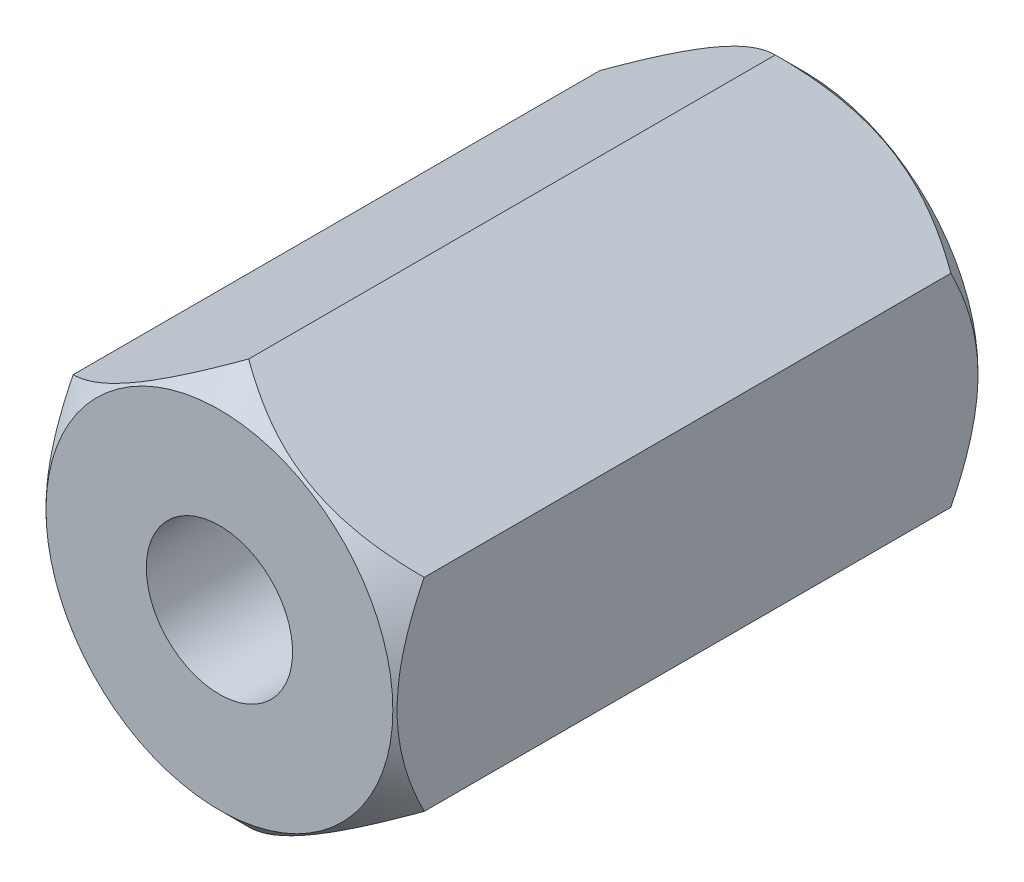
ISO-10303-21;
HEADER;
FILE_DESCRIPTION(('STEP AP214'),'2;1');
FILE_NAME('part.step','',(''),(''),'','','');
FILE_SCHEMA(('AUTOMOTIVE_DESIGN { 1 0 10303 214 1 1 1 1 }'));
ENDSEC;
DATA;
#1=APPLICATION_CONTEXT('core data for automotive mechanical design processes');
#2=APPLICATION_PROTOCOL_DEFINITION('international standard','automotive_design',2000,#1);
#3=PRODUCT_CONTEXT('',#1,'mechanical');
#4=PRODUCT('Part','Part','',(#3));
#5=PRODUCT_RELATED_PRODUCT_CATEGORY('part','',(#4));
#6=PRODUCT_DEFINITION_FORMATION('','',#4);
#7=PRODUCT_DEFINITION_CONTEXT('part definition',#1,'design');
#8=PRODUCT_DEFINITION('design','',#6,#7);
#9=PRODUCT_DEFINITION_SHAPE('','',#8);
#10=(LENGTH_UNIT() NAMED_UNIT(*) SI_UNIT(.MILLI.,.METRE.));
#11=(NAMED_UNIT(*) PLANE_ANGLE_UNIT() SI_UNIT($,.RADIAN.));
#12=(NAMED_UNIT(*) SI_UNIT($,.STERADIAN.) SOLID_ANGLE_UNIT());
#13=UNCERTAINTY_MEASURE_WITH_UNIT(LENGTH_MEASURE(1.E-05),#10,'distance_accuracy_value','');
#14=(GEOMETRIC_REPRESENTATION_CONTEXT(3) GLOBAL_UNCERTAINTY_ASSIGNED_CONTEXT((#13)) GLOBAL_UNIT_ASSIGNED_CONTEXT((#10,
#11,#12)) REPRESENTATION_CONTEXT('',''));
#15=CARTESIAN_POINT('',(0.,0.,0.));
#16=DIRECTION('',(0.,0.,1.));
#17=DIRECTION('',(1.,0.,0.));
#18=AXIS2_PLACEMENT_3D('',#15,#16,#17);
#19=CARTESIAN_POINT('',(2.99999999999996,1.73205080756891,10.));
#20=DIRECTION('',(-0.499999999999998,-0.866025403784439,0.));
#21=DIRECTION('',(0.86602540378444,-0.499999999999999,0.));
#22=AXIS2_PLACEMENT_3D('',#19,#20,#21);
#23=PLANE('',#22);
#24=CARTESIAN_POINT('',(-0.000200000000005701,3.4642170851916,0.500115475827093));
#25=CARTESIAN_POINT('',(0.102923514955752,3.40467869607211,0.440628318321731));
#26=CARTESIAN_POINT('',(0.207771389330664,3.34414474757779,0.384634979465466));
#27=CARTESIAN_POINT('',(0.42156767178113,3.22070940635328,0.282112596378893));
#28=CARTESIAN_POINT('',(0.530536411379804,3.15779627521273,0.235640593741245));
#29=CARTESIAN_POINT('',(0.750266639597091,3.03093496880238,0.156033188516258));
#30=CARTESIAN_POINT('',(0.860972171762284,2.96701910000603,0.122697700642632));
#31=CARTESIAN_POINT('',(1.08482041056542,2.83778025907541,0.0713375439792789));
#32=CARTESIAN_POINT('',(1.19795627920709,2.77246123486014,0.0532745375355815));
#33=CARTESIAN_POINT('',(1.39294095619282,2.65988677911458,0.0369769084504857));
#34=CARTESIAN_POINT('',(1.47453795400227,2.61277673046423,0.0345643671738004));
#35=CARTESIAN_POINT('',(1.63759922883024,2.51863325954789,0.0386294346571176));
#36=CARTESIAN_POINT('',(1.71906344929915,2.47159986993085,0.0451101600283165));
#37=CARTESIAN_POINT('',(1.88122011233856,2.37797867687415,0.0665917225152473));
#38=CARTESIAN_POINT('',(1.9619115887845,2.33139143122678,0.0816020899673097));
#39=CARTESIAN_POINT('',(2.12190869789156,2.23901705721426,0.119323646066059));
#40=CARTESIAN_POINT('',(2.20121443630953,2.19322986779036,0.142034244322884));
#41=CARTESIAN_POINT('',(2.34200614080297,2.11194373930141,0.188760684853999));
#42=CARTESIAN_POINT('',(2.40380372214622,2.07626488907762,0.211548327680848));
#43=CARTESIAN_POINT('',(2.52628941752036,2.00554773988148,0.260796286057478));
#44=CARTESIAN_POINT('',(2.58697749763572,1.97050946049027,0.287256713666218));
#45=CARTESIAN_POINT('',(2.70705299739094,1.90118383838352,0.343256994391358));
#46=CARTESIAN_POINT('',(2.76644383229597,1.8668945238637,0.372787164478353));
#47=CARTESIAN_POINT('',(2.88412556146727,1.79895094584795,0.434539091575483));
#48=CARTESIAN_POINT('',(2.94241710424772,1.76529630793218,0.466759196659295));
#49=CARTESIAN_POINT('',(3.00019999999996,1.73193533751507,0.500115475827071));
#50=B_SPLINE_CURVE_WITH_KNOTS('',3,(#24,#25,#26,#27,#28,#29,#30,#31,#32,#33,#34,#35,#36,#37,#38,
#39,#40,#41,#42,#43,#44,#45,#46,#47,#48,#49),.UNSPECIFIED.,.F.,.F.,(4,2,2,2,2,2,2,2,2,2,2,2,4),
(0.,0.399603557139335,0.801535286397903,1.19708369162351,1.59163620080184,1.8739894175586,
2.15644160919112,2.43921001247448,2.72195674032165,2.94657516661945,3.17120044767284,
3.39513752837811,3.61893808380731),.UNSPECIFIED.);
#51=CARTESIAN_POINT('',(0.,3.46410161513776,0.499999999999945));
#52=VERTEX_POINT('',#51);
#53=CARTESIAN_POINT('',(2.99999999999996,1.73205080756891,0.5));
#54=VERTEX_POINT('',#53);
#55=EDGE_CURVE('E50',#52,#54,#50,.T.);
#56=ORIENTED_EDGE('',*,*,#55,.F.);
#57=DIRECTION('',(0.,0.,-1.));
#58=VECTOR('',#57,1.);
#59=CARTESIAN_POINT('',(0.,3.46410161513776,10.));
#60=LINE('',#59,#58);
#61=CARTESIAN_POINT('',(0.,3.46410161513776,9.49999999999995));
#62=VERTEX_POINT('',#61);
#63=EDGE_CURVE('E11',#62,#52,#60,.T.);
#64=ORIENTED_EDGE('',*,*,#63,.F.);
#65=CARTESIAN_POINT('',(3.00019999999996,1.73193533751507,9.49988452417283));
#66=CARTESIAN_POINT('',(2.89707648504423,1.79147372663454,9.55937168167819));
#67=CARTESIAN_POINT('',(2.79222861066934,1.85200767512885,9.61536502053445));
#68=CARTESIAN_POINT('',(2.57843232821891,1.97544301635334,9.71788740362103));
#69=CARTESIAN_POINT('',(2.46946358862026,2.03835614749387,9.76435940625868));
#70=CARTESIAN_POINT('',(2.24973336040302,2.1652174539042,9.84396681148368));
#71=CARTESIAN_POINT('',(2.13902782823785,2.22913332270054,9.87730229935731));
#72=CARTESIAN_POINT('',(1.91517958943476,2.35837216363112,9.92866245602068));
#73=CARTESIAN_POINT('',(1.8020437207931,2.42369118784639,9.94672546246439));
#74=CARTESIAN_POINT('',(1.60705904380742,2.53626564359192,9.9630230915495));
#75=CARTESIAN_POINT('',(1.525462045998,2.58337569224226,9.9654356328262));
#76=CARTESIAN_POINT('',(1.36240077117007,2.67751916315857,9.9613705653429));
#77=CARTESIAN_POINT('',(1.28093655070118,2.7245525527756,9.95488983997171));
#78=CARTESIAN_POINT('',(1.11877988766182,2.81817374583227,9.93340827748481));
#79=CARTESIAN_POINT('',(1.0380884112159,2.86476099147963,9.91839791003276));
#80=CARTESIAN_POINT('',(0.878091302108889,2.95713536549212,9.88067635393404));
#81=CARTESIAN_POINT('',(0.798785563690938,3.00292255491601,9.85796575567723));
#82=CARTESIAN_POINT('',(0.657993859197469,3.08420868340498,9.81123931514613));
#83=CARTESIAN_POINT('',(0.596196277854174,3.1198875336288,9.78845167231927));
#84=CARTESIAN_POINT('',(0.473710582479936,3.19060468282499,9.7392037139426));
#85=CARTESIAN_POINT('',(0.413022502364531,3.22564296221622,9.71274328633384));
#86=CARTESIAN_POINT('',(0.29294700260923,3.29496858432302,9.65674300560866));
#87=CARTESIAN_POINT('',(0.233556167704154,3.32925789884286,9.62721283552164));
#88=CARTESIAN_POINT('',(0.115874438532764,3.39720147685867,9.56546090842446));
#89=CARTESIAN_POINT('',(0.0575828957522788,3.43085611477446,9.53324080334061));
#90=CARTESIAN_POINT('',(-0.000200000000006075,3.4642170851916,9.4998845241728));
#91=B_SPLINE_CURVE_WITH_KNOTS('',3,(#65,#66,#67,#68,#69,#70,#71,#72,#73,#74,#75,#76,#77,#78,#79,
#80,#81,#82,#83,#84,#85,#86,#87,#88,#89,#90),.UNSPECIFIED.,.F.,.F.,(4,2,2,2,2,2,2,2,2,2,2,2,4),
(0.,0.399603557139267,0.801535286397766,1.19708369162331,1.59163620080157,1.87398941755824,
2.15644160919068,2.43921001247396,2.72195674032105,2.94657516661902,3.17120044767257,
3.39513752837801,3.61893808380738),.UNSPECIFIED.);
#92=CARTESIAN_POINT('',(2.99999999999996,1.73205080756895,9.49999999999995));
#93=VERTEX_POINT('',#92);
#94=EDGE_CURVE('E106',#93,#62,#91,.T.);
#95=ORIENTED_EDGE('',*,*,#94,.F.);
#96=DIRECTION('',(0.,0.,-1.));
#97=VECTOR('',#96,1.);
#98=CARTESIAN_POINT('',(2.99999999999996,1.73205080756891,10.));
#99=LINE('',#98,#97);
#100=EDGE_CURVE('E99',#93,#54,#99,.T.);
#101=ORIENTED_EDGE('',*,*,#100,.T.);
#102=EDGE_LOOP('',(#56,#64,#95,#101));
#103=FACE_BOUND('',#102,.T.);
#104=ADVANCED_FACE('F35',(#103),#23,.F.);
#105=CARTESIAN_POINT('',(0.,3.46410161513776,10.));
#106=DIRECTION('',(0.500000000000001,-0.866025403784438,0.));
#107=DIRECTION('',(0.866025403784438,0.500000000000001,0.));
#108=AXIS2_PLACEMENT_3D('',#105,#106,#107);
#109=PLANE('',#108);
#110=CARTESIAN_POINT('',(-3.00019999999998,1.73193533751505,0.500115475827081));
#111=CARTESIAN_POINT('',(-2.89707648504423,1.79147372663454,0.44062831832172));
#112=CARTESIAN_POINT('',(-2.79222861066932,1.85200767512885,0.384634979465456));
#113=CARTESIAN_POINT('',(-2.57843232821885,1.97544301635337,0.282112596378885));
#114=CARTESIAN_POINT('',(-2.46946358862018,2.03835614749392,0.235640593741238));
#115=CARTESIAN_POINT('',(-2.2497333604029,2.16521745390426,0.156033188516254));
#116=CARTESIAN_POINT('',(-2.13902782823771,2.22913332270062,0.122697700642629));
#117=CARTESIAN_POINT('',(-1.91517958943458,2.35837216363123,0.0713375439792782));
#118=CARTESIAN_POINT('',(-1.8020437207929,2.4236911878465,0.0532745375355812));
#119=CARTESIAN_POINT('',(-1.60705904380717,2.53626564359206,0.0369769084504856));
#120=CARTESIAN_POINT('',(-1.52546204599773,2.58337569224241,0.0345643671738006));
#121=CARTESIAN_POINT('',(-1.36240077116975,2.67751916315875,0.0386294346571182));
#122=CARTESIAN_POINT('',(-1.28093655070084,2.7245525527758,0.0451101600283175));
#123=CARTESIAN_POINT('',(-1.11877988766144,2.81817374583249,0.0665917225152486));
#124=CARTESIAN_POINT('',(-1.0380884112155,2.86476099147986,0.0816020899673109));
#125=CARTESIAN_POINT('',(-0.878091302108441,2.95713536549238,0.119323646066061));
#126=CARTESIAN_POINT('',(-0.79878556369047,3.00292255491628,0.142034244322887));
#127=CARTESIAN_POINT('',(-0.657993859197026,3.08420868340524,0.188760684854002));
#128=CARTESIAN_POINT('',(-0.596196277853776,3.11988753362903,0.211548327680852));
#129=CARTESIAN_POINT('',(-0.473710582479625,3.19060468282517,0.260796286057485));
#130=CARTESIAN_POINT('',(-0.413022502364263,3.22564296221638,0.287256713666226));
#131=CARTESIAN_POINT('',(-0.292947002609044,3.29496858432313,0.34325699439137));
#132=CARTESIAN_POINT('',(-0.23355616770401,3.32925789884295,0.372787164478367));
#133=CARTESIAN_POINT('',(-0.115874438532699,3.39720147685871,0.434539091575501));
#134=CARTESIAN_POINT('',(-0.0575828957522526,3.43085611477448,0.466759196659314));
#135=CARTESIAN_POINT('',(0.000199999999994317,3.4642170851916,0.500115475827093));
#136=B_SPLINE_CURVE_WITH_KNOTS('',3,(#110,#111,#112,#113,#114,#115,#116,#117,#118,#119,#120,
#121,#122,#123,#124,#125,#126,#127,#128,#129,#130,#131,#132,#133,#134,#135),.UNSPECIFIED.,.F.,
.F.,(4,2,2,2,2,2,2,2,2,2,2,2,4),(0.,0.399603557139329,0.801535286397891,1.1970836916235,
1.59163620080182,1.87398941755857,2.1564416091911,2.43921001247446,2.72195674032163,
2.94657516661944,3.17120044767284,3.39513752837812,3.61893808380733),.UNSPECIFIED.);
#137=CARTESIAN_POINT('',(-2.99999999999998,1.73205080756891,0.499999999999945));
#138=VERTEX_POINT('',#137);
#139=EDGE_CURVE('E86',#138,#52,#136,.T.);
#140=ORIENTED_EDGE('',*,*,#139,.F.);
#141=DIRECTION('',(0.,0.,-1.));
#142=VECTOR('',#141,1.);
#143=CARTESIAN_POINT('',(-2.99999999999998,1.73205080756889,10.));
#144=LINE('',#143,#142);
#145=CARTESIAN_POINT('',(-2.99999999999998,1.73205080756891,9.49999999999995));
#146=VERTEX_POINT('',#145);
#147=EDGE_CURVE('E43',#146,#138,#144,.T.);
#148=ORIENTED_EDGE('',*,*,#147,.F.);
#149=CARTESIAN_POINT('',(0.000199999999994519,3.4642170851916,9.4998845241728));
#150=CARTESIAN_POINT('',(-0.102923514955744,3.40467869607212,9.55937168167817));
#151=CARTESIAN_POINT('',(-0.207771389330636,3.34414474757782,9.61536502053444));
#152=CARTESIAN_POINT('',(-0.421567671781061,3.22070940635332,9.71788740362102));
#153=CARTESIAN_POINT('',(-0.530536411379715,3.15779627521278,9.76435940625867));
#154=CARTESIAN_POINT('',(-0.750266639596964,3.03093496880246,9.84396681148367));
#155=CARTESIAN_POINT('',(-0.860972171762137,2.96701910000611,9.87730229935731));
#156=CARTESIAN_POINT('',(-1.08482041056523,2.83778025907552,9.92866245602068));
#157=CARTESIAN_POINT('',(-1.19795627920689,2.77246123486026,9.94672546246439));
#158=CARTESIAN_POINT('',(-1.39294095619258,2.65988677911472,9.9630230915495));
#159=CARTESIAN_POINT('',(-1.474537954002,2.61277673046438,9.9654356328262));
#160=CARTESIAN_POINT('',(-1.63759922882993,2.51863325954807,9.9613705653429));
#161=CARTESIAN_POINT('',(-1.71906344929882,2.47159986993104,9.95488983997171));
#162=CARTESIAN_POINT('',(-1.88122011233818,2.37797867687437,9.93340827748481));
#163=CARTESIAN_POINT('',(-1.9619115887841,2.33139143122701,9.91839791003276));
#164=CARTESIAN_POINT('',(-2.12190869789111,2.23901705721452,9.88067635393404));
#165=CARTESIAN_POINT('',(-2.20121443630906,2.19322986779063,9.85796575567724));
#166=CARTESIAN_POINT('',(-2.34200614080252,2.11194373930166,9.81123931514613));
#167=CARTESIAN_POINT('',(-2.40380372214582,2.07626488907784,9.78845167231927));
#168=CARTESIAN_POINT('',(-2.52628941752005,2.00554773988165,9.73920371394261));
#169=CARTESIAN_POINT('',(-2.58697749763546,1.97050946049042,9.71274328633385));
#170=CARTESIAN_POINT('',(-2.70705299739075,1.90118383838362,9.65674300560867));
#171=CARTESIAN_POINT('',(-2.76644383229583,1.86689452386378,9.62721283552165));
#172=CARTESIAN_POINT('',(-2.88412556146721,1.79895094584798,9.56546090842446));
#173=CARTESIAN_POINT('',(-2.9424171042477,1.76529630793219,9.53324080334063));
#174=CARTESIAN_POINT('',(-3.00019999999998,1.73193533751505,9.49988452417282));
#175=B_SPLINE_CURVE_WITH_KNOTS('',3,(#149,#150,#151,#152,#153,#154,#155,#156,#157,#158,#159,
#160,#161,#162,#163,#164,#165,#166,#167,#168,#169,#170,#171,#172,#173,#174),.UNSPECIFIED.,.F.,
.F.,(4,2,2,2,2,2,2,2,2,2,2,2,4),(0.,0.399603557139277,0.801535286397786,1.19708369162334,
1.59163620080161,1.87398941755828,2.15644160919073,2.43921001247401,2.7219567403211,
2.94657516661905,3.1712004476726,3.39513752837803,3.61893808380739),.UNSPECIFIED.);
#176=EDGE_CURVE('E104',#62,#146,#175,.T.);
#177=ORIENTED_EDGE('',*,*,#176,.F.);
#178=ORIENTED_EDGE('',*,*,#63,.T.);
#179=EDGE_LOOP('',(#140,#148,#177,#178));
#180=FACE_BOUND('',#179,.T.);
#181=ADVANCED_FACE('F103',(#180),#109,.F.);
#182=CARTESIAN_POINT('',(-2.99999999999998,1.73205080756889,10.));
#183=DIRECTION('',(1.,0.,0.));
#184=DIRECTION('',(0.,0.,-1.));
#185=AXIS2_PLACEMENT_3D('',#182,#183,#184);
#186=PLANE('',#185);
#187=CARTESIAN_POINT('',(-2.99999999999998,-3.60017220967197,1.72218048683737));
#188=CARTESIAN_POINT('',(-2.99999999999998,-3.51313765104608,1.65533240857107));
#189=CARTESIAN_POINT('',(-2.99999999999998,-3.42563249287257,1.5890873806316));
#190=CARTESIAN_POINT('',(-2.99999999999998,-3.24948921836687,1.45807845308333));
#191=CARTESIAN_POINT('',(-2.99999999999998,-3.16085083752033,1.39331490949562));
#192=CARTESIAN_POINT('',(-2.99999999999998,-2.98160145725491,1.26508305506886));
#193=CARTESIAN_POINT('',(-2.99999999999998,-2.89098051262283,1.20162860058426));
#194=CARTESIAN_POINT('',(-2.99999999999998,-2.70822761313709,1.07694169073735));
#195=CARTESIAN_POINT('',(-2.99999999999998,-2.6160957631826,1.01570908205705));
#196=CARTESIAN_POINT('',(-2.99999999999998,-2.42422306954662,0.892208762314602));
#197=CARTESIAN_POINT('',(-2.99999999999998,-2.32436788808338,0.830117796525085));
#198=CARTESIAN_POINT('',(-2.99999999999998,-2.12231355534733,0.709809653506304));
#199=CARTESIAN_POINT('',(-2.99999999999998,-2.02011401548867,0.651593124809617));
#200=CARTESIAN_POINT('',(-2.99999999999998,-1.81334633897003,0.540275149217509));
#201=CARTESIAN_POINT('',(-2.99999999999998,-1.70878635206413,0.487158682951906));
#202=CARTESIAN_POINT('',(-2.99999999999998,-1.49671956345562,0.387230840223835));
#203=CARTESIAN_POINT('',(-2.99999999999998,-1.38921417585871,0.340416499767422));
#204=CARTESIAN_POINT('',(-2.99999999999998,-1.18162451020426,0.258946051762336));
#205=CARTESIAN_POINT('',(-2.99999999999998,-1.0818333202557,0.223550747964497));
#206=CARTESIAN_POINT('',(-2.99999999999998,-0.879720922244409,0.160749094146929));
#207=CARTESIAN_POINT('',(-2.99999999999998,-0.777399552418906,0.133343256360222));
#208=CARTESIAN_POINT('',(-2.99999999999998,-0.572612584452553,0.0884558409846684));
#209=CARTESIAN_POINT('',(-2.99999999999998,-0.470186961346654,0.0707949437776184));
#210=CARTESIAN_POINT('',(-2.99999999999998,-0.264078945488416,0.0457637249666116));
#211=CARTESIAN_POINT('',(-2.99999999999998,-0.160396813561062,0.0383913033834457));
#212=CARTESIAN_POINT('',(-2.99999999999998,0.0427096176215057,0.0345579148449175));
#213=CARTESIAN_POINT('',(-2.99999999999998,0.142125414358382,0.0376416494820529));
#214=CARTESIAN_POINT('',(-2.99999999999998,0.340174705597096,0.0535083583046858));
#215=CARTESIAN_POINT('',(-2.99999999999998,0.438808127729325,0.0662922194192052));
#216=CARTESIAN_POINT('',(-2.99999999999998,0.636249949703818,0.101055919672368));
#217=CARTESIAN_POINT('',(-2.99999999999998,0.735029372916008,0.123197581102988));
#218=CARTESIAN_POINT('',(-2.99999999999998,0.930415217780308,0.175452782519873));
#219=CARTESIAN_POINT('',(-2.99999999999998,1.02702176788822,0.205565849901872));
#220=CARTESIAN_POINT('',(-2.99999999999998,1.2236758633486,0.274476354799725));
#221=CARTESIAN_POINT('',(-2.99999999999998,1.32357580295885,0.313690302495117));
#222=CARTESIAN_POINT('',(-2.99999999999998,1.520791158334,0.398168470472808));
#223=CARTESIAN_POINT('',(-2.99999999999998,1.61810572975048,0.443434638911345));
#224=CARTESIAN_POINT('',(-2.99999999999998,1.81063206524874,0.53895130914026));
#225=CARTESIAN_POINT('',(-2.99999999999998,1.90583595858597,0.58921754686616));
#226=CARTESIAN_POINT('',(-2.99999999999998,2.0940594283909,0.693623745361634));
#227=CARTESIAN_POINT('',(-2.99999999999998,2.18707938593184,0.74776302355425));
#228=CARTESIAN_POINT('',(-2.99999999999998,2.36667514656249,0.856408339135955));
#229=CARTESIAN_POINT('',(-2.99999999999998,2.4533423013475,0.910764165621203));
#230=CARTESIAN_POINT('',(-2.99999999999998,2.62518767354664,1.0217874473238));
#231=CARTESIAN_POINT('',(-2.99999999999998,2.71036577854129,1.07845507600888));
#232=CARTESIAN_POINT('',(-2.99999999999998,2.87874255832995,1.19322778247567));
#233=CARTESIAN_POINT('',(-2.99999999999998,2.96195163950994,1.25131764848717));
#234=CARTESIAN_POINT('',(-2.99999999999998,3.12722859541867,1.36905303202698));
#235=CARTESIAN_POINT('',(-2.99999999999998,3.20929677837782,1.4286981163561));
#236=CARTESIAN_POINT('',(-2.99999999999998,3.29088643476973,1.48897973675217));
#237=B_SPLINE_CURVE_WITH_KNOTS('',3,(#187,#188,#189,#190,#191,#192,#193,#194,#195,#196,#197,
#198,#199,#200,#201,#202,#203,#204,#205,#206,#207,#208,#209,#210,#211,#212,#213,#214,#215,#216,
#217,#218,#219,#220,#221,#222,#223,#224,#225,#226,#227,#228,#229,#230,#231,#232,#233,#234,#235,
#236),.UNSPECIFIED.,.F.,.F.,(4,2,2,2,2,2,2,2,2,2,2,2,2,2,2,2,2,2,2,2,2,2,2,2,4),(0.,
0.329237185389712,0.658552677025028,0.990410104597557,1.32224458870019,1.67493114147268,
2.02767658187222,2.37934911783593,2.73085567419858,3.04822903781351,3.36562274488843,
3.67696266306287,3.9882390243945,4.28613845351088,4.58406512428162,4.88736936813588,
5.19065563388327,5.51237069563673,5.83418956505982,6.15705537344444,6.47986442011691,
6.78672818696454,7.09361502205778,7.39803558554833,7.70237224126045),.UNSPECIFIED.);
#238=CARTESIAN_POINT('',(-3.00000000000002,-1.73205080756885,0.499999999999945));
#239=VERTEX_POINT('',#238);
#240=EDGE_CURVE('E89',#239,#138,#237,.T.);
#241=ORIENTED_EDGE('',*,*,#240,.F.);
#242=DIRECTION('',(0.,0.,-1.));
#243=VECTOR('',#242,1.);
#244=CARTESIAN_POINT('',(-2.99999999999998,-1.73205080756887,10.));
#245=LINE('',#244,#243);
#246=CARTESIAN_POINT('',(-3.00000000000002,-1.73205080756885,9.49999999999995));
#247=VERTEX_POINT('',#246);
#248=EDGE_CURVE('E201',#247,#239,#245,.T.);
#249=ORIENTED_EDGE('',*,*,#248,.F.);
#250=CARTESIAN_POINT('',(-2.99999999999998,-3.60017220967163,8.27781951316251));
#251=CARTESIAN_POINT('',(-2.99999999999998,-3.51313765104576,8.34466759142882));
#252=CARTESIAN_POINT('',(-2.99999999999998,-3.42563249287226,8.41091261936829));
#253=CARTESIAN_POINT('',(-2.99999999999998,-3.24948921836659,8.54192154691656));
#254=CARTESIAN_POINT('',(-2.99999999999998,-3.16085083752006,8.60668509050427));
#255=CARTESIAN_POINT('',(-2.99999999999998,-2.98160145725467,8.73491694493103));
#256=CARTESIAN_POINT('',(-2.99999999999998,-2.8909805126226,8.79837139941564));
#257=CARTESIAN_POINT('',(-2.99999999999998,-2.70822761313689,8.92305830926256));
#258=CARTESIAN_POINT('',(-2.99999999999998,-2.61609576318241,8.98429091794286));
#259=CARTESIAN_POINT('',(-2.99999999999998,-2.42422306954646,9.10779123768531));
#260=CARTESIAN_POINT('',(-2.99999999999998,-2.32436788808323,9.16988220347483));
#261=CARTESIAN_POINT('',(-2.99999999999998,-2.12231355534721,9.29019034649362));
#262=CARTESIAN_POINT('',(-2.99999999999998,-2.02011401548856,9.34840687519031));
#263=CARTESIAN_POINT('',(-2.99999999999998,-1.81334633896994,9.45972485078242));
#264=CARTESIAN_POINT('',(-2.99999999999998,-1.70878635206406,9.51284131704803));
#265=CARTESIAN_POINT('',(-2.99999999999998,-1.49671956345557,9.61276915977611));
#266=CARTESIAN_POINT('',(-2.99999999999998,-1.38921417585867,9.65958350023253));
#267=CARTESIAN_POINT('',(-2.99999999999998,-1.18162451020426,9.74105394823762));
#268=CARTESIAN_POINT('',(-2.99999999999998,-1.08183332025572,9.77644925203546));
#269=CARTESIAN_POINT('',(-2.99999999999998,-0.879720922244473,9.83925090585303));
#270=CARTESIAN_POINT('',(-2.99999999999998,-0.777399552418992,9.86665674363974));
#271=CARTESIAN_POINT('',(-2.99999999999998,-0.572612584452682,9.9115441590153));
#272=CARTESIAN_POINT('',(-2.99999999999998,-0.470186961346805,9.92920505622235));
#273=CARTESIAN_POINT('',(-2.99999999999998,-0.264078945488609,9.95423627503337));
#274=CARTESIAN_POINT('',(-2.99999999999998,-0.160396813561276,9.96160869661654));
#275=CARTESIAN_POINT('',(-2.99999999999998,0.0427096176212558,9.96544208515509));
#276=CARTESIAN_POINT('',(-2.99999999999998,0.142125414358117,9.96235835051796));
#277=CARTESIAN_POINT('',(-2.99999999999998,0.340174705596802,9.94649164169534));
#278=CARTESIAN_POINT('',(-2.99999999999998,0.438808127729017,9.93370778058083));
#279=CARTESIAN_POINT('',(-2.99999999999998,0.636249949703482,9.89894408032769));
#280=CARTESIAN_POINT('',(-2.99999999999998,0.735029372915658,9.87680241889708));
#281=CARTESIAN_POINT('',(-2.99999999999998,0.930415217779929,9.82454721748021));
#282=CARTESIAN_POINT('',(-2.99999999999998,1.02702176788783,9.79443415009822));
#283=CARTESIAN_POINT('',(-2.99999999999998,1.22367586334814,9.7255236452004));
#284=CARTESIAN_POINT('',(-2.99999999999998,1.32357580295833,9.68630969750503));
#285=CARTESIAN_POINT('',(-2.99999999999998,1.52079115833336,9.6018315295274));
#286=CARTESIAN_POINT('',(-2.99999999999998,1.61810572974978,9.55656536108889));
#287=CARTESIAN_POINT('',(-2.99999999999998,1.81063206524793,9.46104869086004));
#288=CARTESIAN_POINT('',(-2.99999999999998,1.90583595858511,9.41078245313418));
#289=CARTESIAN_POINT('',(-2.99999999999998,2.09405942838993,9.30637625463878));
#290=CARTESIAN_POINT('',(-2.99999999999998,2.18707938593081,9.25223697644619));
#291=CARTESIAN_POINT('',(-2.99999999999998,2.36667514656136,9.14359166086456));
#292=CARTESIAN_POINT('',(-2.99999999999998,2.45334230134632,9.08923583437934));
#293=CARTESIAN_POINT('',(-2.99999999999998,2.62518767354537,8.97821255267681));
#294=CARTESIAN_POINT('',(-2.99999999999998,2.71036577853998,8.92154492399177));
#295=CARTESIAN_POINT('',(-2.99999999999998,2.87874255832855,8.80677221752504));
#296=CARTESIAN_POINT('',(-2.99999999999998,2.96195163950849,8.74868235151358));
#297=CARTESIAN_POINT('',(-2.99999999999998,3.12722859541713,8.63094696797384));
#298=CARTESIAN_POINT('',(-2.99999999999998,3.20929677837623,8.57130188364475));
#299=CARTESIAN_POINT('',(-2.99999999999998,3.29088643476809,8.51102026324872));
#300=B_SPLINE_CURVE_WITH_KNOTS('',3,(#250,#251,#252,#253,#254,#255,#256,#257,#258,#259,#260,
#261,#262,#263,#264,#265,#266,#267,#268,#269,#270,#271,#272,#273,#274,#275,#276,#277,#278,#279,
#280,#281,#282,#283,#284,#285,#286,#287,#288,#289,#290,#291,#292,#293,#294,#295,#296,#297,#298,
#299),.UNSPECIFIED.,.F.,.F.,(4,2,2,2,2,2,2,2,2,2,2,2,2,2,2,2,2,2,2,2,2,2,2,2,4),(0.,
0.329237185389683,0.658552677024968,0.990410104597468,1.32224458870008,1.67493114147253,
2.02767658187204,2.37934911783573,2.73085567419835,3.04822903781321,3.36562274488808,
3.67696266306246,3.98823902439403,4.28613845351036,4.58406512428106,4.88736936813527,
5.19065563388261,5.51237069563588,5.83418956505878,6.1570553734432,6.47986442011548,
6.78672818696293,7.093615022056,7.39803558554638,7.70237224125833),.UNSPECIFIED.);
#301=EDGE_CURVE('E107',#146,#247,#300,.F.);
#302=ORIENTED_EDGE('',*,*,#301,.F.);
#303=ORIENTED_EDGE('',*,*,#147,.T.);
#304=EDGE_LOOP('',(#241,#249,#302,#303));
#305=FACE_BOUND('',#304,.T.);
#306=ADVANCED_FACE('F162',(#305),#186,.F.);
#307=CARTESIAN_POINT('',(-2.99999999999998,-1.73205080756887,10.));
#308=DIRECTION('',(0.499999999999999,0.866025403784439,0.));
#309=DIRECTION('',(-0.866025403784439,0.499999999999999,0.));
#310=AXIS2_PLACEMENT_3D('',#307,#308,#309);
#311=PLANE('',#310);
#312=CARTESIAN_POINT('',(0.000200000000013938,-3.46421708519158,0.500115475827079));
#313=CARTESIAN_POINT('',(-0.102923514955744,-3.40467869607209,0.440628318321718));
#314=CARTESIAN_POINT('',(-0.207771389330656,-3.34414474757778,0.384634979465452));
#315=CARTESIAN_POINT('',(-0.421567671781122,-3.22070940635326,0.282112596378877));
#316=CARTESIAN_POINT('',(-0.530536411379796,-3.15779627521271,0.235640593741229));
#317=CARTESIAN_POINT('',(-0.750266639597084,-3.03093496880236,0.156033188516241));
#318=CARTESIAN_POINT('',(-0.860972171762277,-2.96701910000601,0.122697700642615));
#319=CARTESIAN_POINT('',(-1.08482041056541,-2.8377802590754,0.0713375439792616));
#320=CARTESIAN_POINT('',(-1.19795627920709,-2.77246123486012,0.053274537535564));
#321=CARTESIAN_POINT('',(-1.39294095619281,-2.65988677911456,0.0369769084504681));
#322=CARTESIAN_POINT('',(-1.47453795400226,-2.61277673046421,0.0345643671737829));
#323=CARTESIAN_POINT('',(-1.63759922883024,-2.51863325954788,0.0386294346570998));
#324=CARTESIAN_POINT('',(-1.71906344929915,-2.47159986993083,0.0451101600282983));
#325=CARTESIAN_POINT('',(-1.88122011233855,-2.37797867687414,0.0665917225152288));
#326=CARTESIAN_POINT('',(-1.96191158878449,-2.33139143122676,0.0816020899672912));
#327=CARTESIAN_POINT('',(-2.12190869789154,-2.23901705721425,0.119323646066041));
#328=CARTESIAN_POINT('',(-2.20121443630952,-2.19322986779035,0.142034244322866));
#329=CARTESIAN_POINT('',(-2.34200614080296,-2.11194373930139,0.188760684853981));
#330=CARTESIAN_POINT('',(-2.40380372214621,-2.0762648890776,0.211548327680831));
#331=CARTESIAN_POINT('',(-2.52628941752036,-2.00554773988145,0.260796286057464));
#332=CARTESIAN_POINT('',(-2.58697749763572,-1.97050946049025,0.287256713666205));
#333=CARTESIAN_POINT('',(-2.70705299739094,-1.90118383838349,0.343256994391349));
#334=CARTESIAN_POINT('',(-2.76644383229598,-1.86689452386368,0.372787164478346));
#335=CARTESIAN_POINT('',(-2.88412556146729,-1.79895094584792,0.434539091575479));
#336=CARTESIAN_POINT('',(-2.94241710424774,-1.76529630793215,0.466759196659293));
#337=CARTESIAN_POINT('',(-3.00019999999998,-1.73193533751503,0.500115475827072));
#338=B_SPLINE_CURVE_WITH_KNOTS('',3,(#312,#313,#314,#315,#316,#317,#318,#319,#320,#321,#322,
#323,#324,#325,#326,#327,#328,#329,#330,#331,#332,#333,#334,#335,#336,#337),.UNSPECIFIED.,.F.,
.F.,(4,2,2,2,2,2,2,2,2,2,2,2,4),(0.,0.399603557139336,0.801535286397905,1.19708369162352,
1.59163620080185,1.8739894175586,2.15644160919112,2.43921001247448,2.72195674032165,
2.94657516661946,3.17120044767286,3.39513752837814,3.61893808380735),.UNSPECIFIED.);
#339=CARTESIAN_POINT('',(0.,-3.46410161513776,0.499999999999945));
#340=VERTEX_POINT('',#339);
#341=EDGE_CURVE('E168',#340,#239,#338,.T.);
#342=ORIENTED_EDGE('',*,*,#341,.F.);
#343=DIRECTION('',(0.,0.,-1.));
#344=VECTOR('',#343,1.);
#345=CARTESIAN_POINT('',(0.,-3.46410161513774,10.));
#346=LINE('',#345,#344);
#347=CARTESIAN_POINT('',(0.,-3.46410161513776,9.49999999999995));
#348=VERTEX_POINT('',#347);
#349=EDGE_CURVE('E196',#348,#340,#346,.T.);
#350=ORIENTED_EDGE('',*,*,#349,.F.);
#351=CARTESIAN_POINT('',(-3.00019999999998,-1.73193533751503,9.49988452417283));
#352=CARTESIAN_POINT('',(-2.89707648504424,-1.79147372663451,9.55937168167819));
#353=CARTESIAN_POINT('',(-2.79222861066935,-1.85200767512881,9.61536502053446));
#354=CARTESIAN_POINT('',(-2.57843232821893,-1.97544301635331,9.71788740362104));
#355=CARTESIAN_POINT('',(-2.46946358862028,-2.03835614749384,9.76435940625869));
#356=CARTESIAN_POINT('',(-2.24973336040303,-2.16521745390417,9.84396681148369));
#357=CARTESIAN_POINT('',(-2.13902782823785,-2.22913332270051,9.87730229935732));
#358=CARTESIAN_POINT('',(-1.91517958943476,-2.3583721636311,9.9286624560207));
#359=CARTESIAN_POINT('',(-1.8020437207931,-2.42369118784636,9.94672546246441));
#360=CARTESIAN_POINT('',(-1.60705904380742,-2.5362656435919,9.96302309154952));
#361=CARTESIAN_POINT('',(-1.525462045998,-2.58337569224224,9.96543563282622));
#362=CARTESIAN_POINT('',(-1.36240077117007,-2.67751916315855,9.96137056534292));
#363=CARTESIAN_POINT('',(-1.28093655070118,-2.72455255277558,9.95488983997173));
#364=CARTESIAN_POINT('',(-1.11877988766182,-2.81817374583225,9.93340827748483));
#365=CARTESIAN_POINT('',(-1.0380884112159,-2.86476099147961,9.91839791003278));
#366=CARTESIAN_POINT('',(-0.87809130210889,-2.9571353654921,9.88067635393406));
#367=CARTESIAN_POINT('',(-0.79878556369094,-3.00292255491599,9.85796575567725));
#368=CARTESIAN_POINT('',(-0.657993859197471,-3.08420868340496,9.81123931514615));
#369=CARTESIAN_POINT('',(-0.596196277854175,-3.11988753362878,9.78845167231928));
#370=CARTESIAN_POINT('',(-0.473710582479935,-3.19060468282497,9.73920371394262));
#371=CARTESIAN_POINT('',(-0.413022502364529,-3.2256429622162,9.71274328633386));
#372=CARTESIAN_POINT('',(-0.292947002609226,-3.294968584323,9.65674300560868));
#373=CARTESIAN_POINT('',(-0.23355616770415,-3.32925789884285,9.62721283552166));
#374=CARTESIAN_POINT('',(-0.115874438532758,-3.39720147685865,9.56546090842447));
#375=CARTESIAN_POINT('',(-0.0575828957522717,-3.43085611477444,9.53324080334063));
#376=CARTESIAN_POINT('',(0.000200000000014136,-3.46421708519158,9.49988452417282));
#377=B_SPLINE_CURVE_WITH_KNOTS('',3,(#351,#352,#353,#354,#355,#356,#357,#358,#359,#360,#361,
#362,#363,#364,#365,#366,#367,#368,#369,#370,#371,#372,#373,#374,#375,#376),.UNSPECIFIED.,.F.,
.F.,(4,2,2,2,2,2,2,2,2,2,2,2,4),(0.,0.399603557139274,0.80153528639778,1.19708369162333,
1.5916362008016,1.87398941755827,2.15644160919071,2.43921001247399,2.72195674032108,
2.94657516661905,3.17120044767261,3.39513752837805,3.61893808380742),.UNSPECIFIED.);
#378=EDGE_CURVE('E110',#247,#348,#377,.T.);
#379=ORIENTED_EDGE('',*,*,#378,.F.);
#380=ORIENTED_EDGE('',*,*,#248,.T.);
#381=EDGE_LOOP('',(#342,#350,#379,#380));
#382=FACE_BOUND('',#381,.T.);
#383=ADVANCED_FACE('F158',(#382),#311,.F.);
#384=CARTESIAN_POINT('',(0.,-3.46410161513774,10.));
#385=DIRECTION('',(-0.499999999999999,0.866025403784439,0.));
#386=DIRECTION('',(-0.866025403784439,-0.499999999999999,0.));
#387=AXIS2_PLACEMENT_3D('',#384,#385,#386);
#388=PLANE('',#387);
#389=CARTESIAN_POINT('',(3.00019999999996,-1.73193533751506,0.500115475827068));
#390=CARTESIAN_POINT('',(2.89707648504421,-1.79147372663455,0.440628318321709));
#391=CARTESIAN_POINT('',(2.7922286106693,-1.85200767512886,0.384634979465445));
#392=CARTESIAN_POINT('',(2.57843232821884,-1.97544301635338,0.282112596378876));
#393=CARTESIAN_POINT('',(2.46946358862016,-2.03835614749392,0.23564059374123));
#394=CARTESIAN_POINT('',(2.24973336040288,-2.16521745390427,0.156033188516247));
#395=CARTESIAN_POINT('',(2.13902782823769,-2.22913332270062,0.122697700642623));
#396=CARTESIAN_POINT('',(1.91517958943456,-2.35837216363123,0.0713375439792725));
#397=CARTESIAN_POINT('',(1.80204372079289,-2.4236911878465,0.0532745375355761));
#398=CARTESIAN_POINT('',(1.60705904380716,-2.53626564359206,0.0369769084504813));
#399=CARTESIAN_POINT('',(1.52546204599772,-2.58337569224241,0.0345643671737965));
#400=CARTESIAN_POINT('',(1.36240077116974,-2.67751916315875,0.0386294346571143));
#401=CARTESIAN_POINT('',(1.28093655070083,-2.7245525527758,0.0451101600283135));
#402=CARTESIAN_POINT('',(1.11877988766143,-2.81817374583249,0.0665917225152448));
#403=CARTESIAN_POINT('',(1.03808841121549,-2.86476099147986,0.0816020899673073));
#404=CARTESIAN_POINT('',(0.878091302108431,-2.95713536549238,0.119323646066057));
#405=CARTESIAN_POINT('',(0.79878556369046,-3.00292255491628,0.142034244322883));
#406=CARTESIAN_POINT('',(0.657993859197018,-3.08420868340523,0.188760684853998));
#407=CARTESIAN_POINT('',(0.596196277853769,-3.11988753362903,0.211548327680847));
#408=CARTESIAN_POINT('',(0.473710582479622,-3.19060468282517,0.260796286057479));
#409=CARTESIAN_POINT('',(0.413022502364261,-3.22564296221637,0.28725671366622));
#410=CARTESIAN_POINT('',(0.292947002609046,-3.29496858432313,0.343256994391362));
#411=CARTESIAN_POINT('',(0.233556167704012,-3.32925789884294,0.372787164478358));
#412=CARTESIAN_POINT('',(0.115874438532704,-3.3972014768587,0.434539091575489));
#413=CARTESIAN_POINT('',(0.0575828957522594,-3.43085611477447,0.466759196659302));
#414=CARTESIAN_POINT('',(-0.000199999999986049,-3.46421708519158,0.500115475827079));
#415=B_SPLINE_CURVE_WITH_KNOTS('',3,(#389,#390,#391,#392,#393,#394,#395,#396,#397,#398,#399,
#400,#401,#402,#403,#404,#405,#406,#407,#408,#409,#410,#411,#412,#413,#414),.UNSPECIFIED.,.F.,
.F.,(4,2,2,2,2,2,2,2,2,2,2,2,4),(0.,0.399603557139325,0.801535286397883,1.19708369162349,
1.5916362008018,1.87398941755856,2.15644160919108,2.43921001247444,2.72195674032161,
2.94657516661942,3.17120044767281,3.39513752837808,3.61893808380729),.UNSPECIFIED.);
#416=CARTESIAN_POINT('',(2.99999999999996,-1.73205080756895,0.499999999999945));
#417=VERTEX_POINT('',#416);
#418=EDGE_CURVE('E174',#417,#340,#415,.T.);
#419=ORIENTED_EDGE('',*,*,#418,.F.);
#420=DIRECTION('',(0.,0.,-1.));
#421=VECTOR('',#420,1.);
#422=CARTESIAN_POINT('',(2.99999999999996,-1.7320508075689,10.));
#423=LINE('',#422,#421);
#424=CARTESIAN_POINT('',(2.99999999999996,-1.7320508075689,9.5));
#425=VERTEX_POINT('',#424);
#426=EDGE_CURVE('E195',#425,#417,#423,.T.);
#427=ORIENTED_EDGE('',*,*,#426,.F.);
#428=CARTESIAN_POINT('',(-0.000199999999986309,-3.46421708519158,9.49988452417282));
#429=CARTESIAN_POINT('',(0.102923514955751,-3.40467869607211,9.55937168167818));
#430=CARTESIAN_POINT('',(0.207771389330642,-3.3441447475778,9.61536502053445));
#431=CARTESIAN_POINT('',(0.421567671781066,-3.22070940635331,9.71788740362103));
#432=CARTESIAN_POINT('',(0.530536411379719,-3.15779627521277,9.76435940625868));
#433=CARTESIAN_POINT('',(0.750266639596966,-3.03093496880245,9.84396681148368));
#434=CARTESIAN_POINT('',(0.860972171762138,-2.9670191000061,9.87730229935731));
#435=CARTESIAN_POINT('',(1.08482041056523,-2.83778025907552,9.92866245602068));
#436=CARTESIAN_POINT('',(1.19795627920689,-2.77246123486025,9.94672546246439));
#437=CARTESIAN_POINT('',(1.39294095619258,-2.65988677911471,9.96302309154951));
#438=CARTESIAN_POINT('',(1.474537954002,-2.61277673046438,9.9654356328262));
#439=CARTESIAN_POINT('',(1.63759922882993,-2.51863325954807,9.96137056534291));
#440=CARTESIAN_POINT('',(1.71906344929881,-2.47159986993104,9.95488983997172));
#441=CARTESIAN_POINT('',(1.88122011233817,-2.37797867687437,9.93340827748481));
#442=CARTESIAN_POINT('',(1.96191158878409,-2.33139143122701,9.91839791003277));
#443=CARTESIAN_POINT('',(2.1219086978911,-2.23901705721452,9.88067635393405));
#444=CARTESIAN_POINT('',(2.20121443630905,-2.19322986779063,9.85796575567724));
#445=CARTESIAN_POINT('',(2.34200614080252,-2.11194373930166,9.81123931514613));
#446=CARTESIAN_POINT('',(2.40380372214581,-2.07626488907785,9.78845167231927));
#447=CARTESIAN_POINT('',(2.52628941752004,-2.00554773988165,9.73920371394261));
#448=CARTESIAN_POINT('',(2.58697749763544,-1.97050946049043,9.71274328633386));
#449=CARTESIAN_POINT('',(2.70705299739074,-1.90118383838363,9.65674300560867));
#450=CARTESIAN_POINT('',(2.76644383229581,-1.86689452386379,9.62721283552166));
#451=CARTESIAN_POINT('',(2.8841255614672,-1.79895094584799,9.56546090842448));
#452=CARTESIAN_POINT('',(2.94241710424768,-1.7652963079322,9.53324080334064));
#453=CARTESIAN_POINT('',(3.00019999999996,-1.73193533751506,9.49988452417283));
#454=B_SPLINE_CURVE_WITH_KNOTS('',3,(#428,#429,#430,#431,#432,#433,#434,#435,#436,#437,#438,
#439,#440,#441,#442,#443,#444,#445,#446,#447,#448,#449,#450,#451,#452,#453),.UNSPECIFIED.,.F.,
.F.,(4,2,2,2,2,2,2,2,2,2,2,2,4),(0.,0.399603557139273,0.801535286397778,1.19708369162333,
1.5916362008016,1.87398941755827,2.15644160919071,2.43921001247399,2.72195674032108,
2.94657516661903,3.17120044767257,3.395137528378,3.61893808380735),.UNSPECIFIED.);
#455=EDGE_CURVE('E58',#348,#425,#454,.T.);
#456=ORIENTED_EDGE('',*,*,#455,.F.);
#457=ORIENTED_EDGE('',*,*,#349,.T.);
#458=EDGE_LOOP('',(#419,#427,#456,#457));
#459=FACE_BOUND('',#458,.T.);
#460=ADVANCED_FACE('F161',(#459),#388,.F.);
#461=CARTESIAN_POINT('',(2.99999999999996,-1.7320508075689,10.));
#462=DIRECTION('',(-1.,0.,0.));
#463=DIRECTION('',(0.,0.,1.));
#464=AXIS2_PLACEMENT_3D('',#461,#462,#463);
#465=PLANE('',#464);
#466=CARTESIAN_POINT('',(2.99999999999996,-3.60017220967202,1.7221804868374));
#467=CARTESIAN_POINT('',(2.99999999999996,-3.51313765104614,1.6553324085711));
#468=CARTESIAN_POINT('',(2.99999999999996,-3.42563249287262,1.58908738063162));
#469=CARTESIAN_POINT('',(2.99999999999996,-3.24948921836692,1.45807845308336));
#470=CARTESIAN_POINT('',(2.99999999999996,-3.16085083752038,1.39331490949564));
#471=CARTESIAN_POINT('',(2.99999999999996,-2.98160145725496,1.26508305506888));
#472=CARTESIAN_POINT('',(2.99999999999996,-2.89098051262287,1.20162860058427));
#473=CARTESIAN_POINT('',(2.99999999999996,-2.70822761313714,1.07694169073736));
#474=CARTESIAN_POINT('',(2.99999999999996,-2.61609576318264,1.01570908205706));
#475=CARTESIAN_POINT('',(2.99999999999996,-2.42422306954666,0.892208762314612));
#476=CARTESIAN_POINT('',(2.99999999999996,-2.32436788808342,0.830117796525093));
#477=CARTESIAN_POINT('',(2.99999999999996,-2.12231355534737,0.709809653506309));
#478=CARTESIAN_POINT('',(2.99999999999996,-2.02011401548871,0.65159312480962));
#479=CARTESIAN_POINT('',(2.99999999999996,-1.81334633897006,0.540275149217509));
#480=CARTESIAN_POINT('',(2.99999999999996,-1.70878635206416,0.487158682951904));
#481=CARTESIAN_POINT('',(2.99999999999996,-1.49671956345565,0.387230840223828));
#482=CARTESIAN_POINT('',(2.99999999999996,-1.38921417585873,0.340416499767415));
#483=CARTESIAN_POINT('',(2.99999999999996,-1.18162451020429,0.258946051762326));
#484=CARTESIAN_POINT('',(2.99999999999996,-1.08183332025573,0.223550747964485));
#485=CARTESIAN_POINT('',(2.99999999999996,-0.879720922244433,0.160749094146915));
#486=CARTESIAN_POINT('',(2.99999999999996,-0.777399552418929,0.133343256360207));
#487=CARTESIAN_POINT('',(2.99999999999996,-0.572612584452574,0.0884558409846515));
#488=CARTESIAN_POINT('',(2.99999999999996,-0.470186961346674,0.0707949437776009));
#489=CARTESIAN_POINT('',(2.99999999999996,-0.264078945488435,0.0457637249665928));
#490=CARTESIAN_POINT('',(2.99999999999996,-0.16039681356108,0.0383913033834261));
#491=CARTESIAN_POINT('',(2.99999999999996,0.0427096176214889,0.0345579148448964));
#492=CARTESIAN_POINT('',(2.99999999999996,0.142125414358366,0.0376416494820313));
#493=CARTESIAN_POINT('',(2.99999999999996,0.340174705597081,0.0535083583046633));
#494=CARTESIAN_POINT('',(2.99999999999996,0.438808127729309,0.0662922194191824));
#495=CARTESIAN_POINT('',(2.99999999999996,0.636249949703804,0.101055919672345));
#496=CARTESIAN_POINT('',(2.99999999999996,0.735029372915995,0.123197581102964));
#497=CARTESIAN_POINT('',(2.99999999999996,0.930415217780295,0.17545278251985));
#498=CARTESIAN_POINT('',(2.99999999999996,1.02702176788821,0.205565849901849));
#499=CARTESIAN_POINT('',(2.99999999999996,1.22367586334859,0.274476354799701));
#500=CARTESIAN_POINT('',(2.99999999999996,1.32357580295884,0.313690302495092));
#501=CARTESIAN_POINT('',(2.99999999999996,1.52079115833398,0.398168470472782));
#502=CARTESIAN_POINT('',(2.99999999999996,1.61810572975046,0.443434638911318));
#503=CARTESIAN_POINT('',(2.99999999999996,1.81063206524872,0.538951309140231));
#504=CARTESIAN_POINT('',(2.99999999999996,1.90583595858595,0.589217546866131));
#505=CARTESIAN_POINT('',(2.99999999999996,2.09405942839087,0.693623745361603));
#506=CARTESIAN_POINT('',(2.99999999999996,2.18707938593181,0.747763023554218));
#507=CARTESIAN_POINT('',(2.99999999999996,2.36667514656246,0.856408339135922));
#508=CARTESIAN_POINT('',(2.99999999999996,2.45334230134747,0.910764165621169));
#509=CARTESIAN_POINT('',(2.99999999999996,2.62518767354661,1.02178744732377));
#510=CARTESIAN_POINT('',(2.99999999999996,2.71036577854126,1.07845507600884));
#511=CARTESIAN_POINT('',(2.99999999999996,2.87874255832992,1.19322778247564));
#512=CARTESIAN_POINT('',(2.99999999999996,2.96195163950991,1.25131764848713));
#513=CARTESIAN_POINT('',(2.99999999999996,3.12722859541864,1.36905303202694));
#514=CARTESIAN_POINT('',(2.99999999999996,3.20929677837778,1.42869811635606));
#515=CARTESIAN_POINT('',(2.99999999999996,3.29088643476969,1.48897973675213));
#516=B_SPLINE_CURVE_WITH_KNOTS('',3,(#466,#467,#468,#469,#470,#471,#472,#473,#474,#475,#476,
#477,#478,#479,#480,#481,#482,#483,#484,#485,#486,#487,#488,#489,#490,#491,#492,#493,#494,#495,
#496,#497,#498,#499,#500,#501,#502,#503,#504,#505,#506,#507,#508,#509,#510,#511,#512,#513,#514,
#515),.UNSPECIFIED.,.F.,.F.,(4,2,2,2,2,2,2,2,2,2,2,2,2,2,2,2,2,2,2,2,2,2,2,2,4),(0.,
0.329237185389718,0.658552677025039,0.990410104597574,1.32224458870021,1.67493114147271,
2.02767658187225,2.37934911783597,2.73085567419863,3.04822903781356,3.36562274488849,
3.67696266306293,3.98823902439456,4.28613845351094,4.58406512428168,4.88736936813594,
5.19065563388334,5.51237069563679,5.83418956505987,6.15705537344449,6.47986442011696,
6.78672818696458,7.09361502205782,7.39803558554837,7.70237224126048),.UNSPECIFIED.);
#517=EDGE_CURVE('E194',#54,#417,#516,.F.);
#518=ORIENTED_EDGE('',*,*,#517,.F.);
#519=ORIENTED_EDGE('',*,*,#100,.F.);
#520=CARTESIAN_POINT('',(2.99999999999996,-3.60017220967168,8.27781951316249));
#521=CARTESIAN_POINT('',(2.99999999999996,-3.51313765104581,8.34466759142879));
#522=CARTESIAN_POINT('',(2.99999999999996,-3.42563249287231,8.41091261936827));
#523=CARTESIAN_POINT('',(2.99999999999996,-3.24948921836664,8.54192154691654));
#524=CARTESIAN_POINT('',(2.99999999999996,-3.16085083752011,8.60668509050426));
#525=CARTESIAN_POINT('',(2.99999999999996,-2.98160145725472,8.73491694493102));
#526=CARTESIAN_POINT('',(2.99999999999996,-2.89098051262265,8.79837139941563));
#527=CARTESIAN_POINT('',(2.99999999999996,-2.70822761313694,8.92305830926254));
#528=CARTESIAN_POINT('',(2.99999999999996,-2.61609576318245,8.98429091794284));
#529=CARTESIAN_POINT('',(2.99999999999996,-2.4242230695465,9.1077912376853));
#530=CARTESIAN_POINT('',(2.99999999999996,-2.32436788808327,9.16988220347482));
#531=CARTESIAN_POINT('',(2.99999999999996,-2.12231355534725,9.29019034649361));
#532=CARTESIAN_POINT('',(2.99999999999996,-2.0201140154886,9.3484068751903));
#533=CARTESIAN_POINT('',(2.99999999999996,-1.81334633896998,9.45972485078242));
#534=CARTESIAN_POINT('',(2.99999999999996,-1.70878635206409,9.51284131704803));
#535=CARTESIAN_POINT('',(2.99999999999996,-1.4967195634556,9.61276915977611));
#536=CARTESIAN_POINT('',(2.99999999999996,-1.3892141758587,9.65958350023253));
#537=CARTESIAN_POINT('',(2.99999999999996,-1.18162451020428,9.74105394823762));
#538=CARTESIAN_POINT('',(2.99999999999996,-1.08183332025575,9.77644925203547));
#539=CARTESIAN_POINT('',(2.99999999999996,-0.879720922244498,9.83925090585304));
#540=CARTESIAN_POINT('',(2.99999999999996,-0.777399552419016,9.86665674363975));
#541=CARTESIAN_POINT('',(2.99999999999996,-0.572612584452705,9.91154415901531));
#542=CARTESIAN_POINT('',(2.99999999999996,-0.470186961346828,9.92920505622237));
#543=CARTESIAN_POINT('',(2.99999999999996,-0.264078945488631,9.95423627503339));
#544=CARTESIAN_POINT('',(2.99999999999996,-0.160396813561297,9.96160869661656));
#545=CARTESIAN_POINT('',(2.99999999999996,0.0427096176212353,9.96544208515511));
#546=CARTESIAN_POINT('',(2.99999999999996,0.142125414358097,9.96235835051798));
#547=CARTESIAN_POINT('',(2.99999999999996,0.340174705596783,9.94649164169537));
#548=CARTESIAN_POINT('',(2.99999999999996,0.438808127728998,9.93370778058086));
#549=CARTESIAN_POINT('',(2.99999999999996,0.636249949703464,9.89894408032771));
#550=CARTESIAN_POINT('',(2.99999999999996,0.73502937291564,9.8768024188971));
#551=CARTESIAN_POINT('',(2.99999999999996,0.930415217779914,9.82454721748023));
#552=CARTESIAN_POINT('',(2.99999999999996,1.02702176788782,9.79443415009824));
#553=CARTESIAN_POINT('',(2.99999999999996,1.22367586334812,9.72552364520042));
#554=CARTESIAN_POINT('',(2.99999999999996,1.32357580295831,9.68630969750506));
#555=CARTESIAN_POINT('',(2.99999999999996,1.52079115833334,9.60183152952743));
#556=CARTESIAN_POINT('',(2.99999999999996,1.61810572974976,9.55656536108892));
#557=CARTESIAN_POINT('',(2.99999999999996,1.81063206524791,9.46104869086007));
#558=CARTESIAN_POINT('',(2.99999999999996,1.90583595858509,9.41078245313421));
#559=CARTESIAN_POINT('',(2.99999999999996,2.0940594283899,9.30637625463881));
#560=CARTESIAN_POINT('',(2.99999999999996,2.18707938593079,9.25223697644623));
#561=CARTESIAN_POINT('',(2.99999999999996,2.36667514656133,9.14359166086459));
#562=CARTESIAN_POINT('',(2.99999999999996,2.45334230134629,9.08923583437938));
#563=CARTESIAN_POINT('',(2.99999999999996,2.62518767354534,8.97821255267685));
#564=CARTESIAN_POINT('',(2.99999999999996,2.71036577853994,8.92154492399181));
#565=CARTESIAN_POINT('',(2.99999999999996,2.87874255832852,8.80677221752508));
#566=CARTESIAN_POINT('',(2.99999999999996,2.96195163950845,8.74868235151362));
#567=CARTESIAN_POINT('',(2.99999999999996,3.12722859541709,8.63094696797388));
#568=CARTESIAN_POINT('',(2.99999999999996,3.20929677837619,8.5713018836448));
#569=CARTESIAN_POINT('',(2.99999999999996,3.29088643476805,8.51102026324876));
#570=B_SPLINE_CURVE_WITH_KNOTS('',3,(#520,#521,#522,#523,#524,#525,#526,#527,#528,#529,#530,
#531,#532,#533,#534,#535,#536,#537,#538,#539,#540,#541,#542,#543,#544,#545,#546,#547,#548,#549,
#550,#551,#552,#553,#554,#555,#556,#557,#558,#559,#560,#561,#562,#563,#564,#565,#566,#567,#568,
#569),.UNSPECIFIED.,.F.,.F.,(4,2,2,2,2,2,2,2,2,2,2,2,2,2,2,2,2,2,2,2,2,2,2,2,4),(0.,
0.329237185389688,0.658552677024978,0.990410104597483,1.32224458870009,1.67493114147256,
2.02767658187207,2.37934911783576,2.7308556741984,3.04822903781326,3.36562274488813,
3.67696266306251,3.98823902439408,4.28613845351041,4.58406512428111,4.88736936813532,
5.19065563388267,5.51237069563593,5.83418956505882,6.15705537344325,6.47986442011552,
6.78672818696297,7.09361502205603,7.39803558554641,7.70237224125836),.UNSPECIFIED.);
#571=EDGE_CURVE('E140',#425,#93,#570,.T.);
#572=ORIENTED_EDGE('',*,*,#571,.F.);
#573=ORIENTED_EDGE('',*,*,#426,.T.);
#574=EDGE_LOOP('',(#518,#519,#572,#573));
#575=FACE_BOUND('',#574,.T.);
#576=ADVANCED_FACE('F132',(#575),#465,.F.);
#577=CARTESIAN_POINT('',(0.,0.,10.));
#578=DIRECTION('',(0.,0.,-1.));
#579=DIRECTION('',(-1.,0.,0.));
#580=AXIS2_PLACEMENT_3D('',#577,#578,#579);
#581=CONICAL_SURFACE('',#580,2.96410161513776,0.785398163397393);
#582=CARTESIAN_POINT('',(0.,0.,10.));
#583=DIRECTION('',(0.,0.,1.));
#584=DIRECTION('',(1.,0.,0.));
#585=AXIS2_PLACEMENT_3D('',#582,#583,#584);
#586=CIRCLE('',#585,2.96410161513776);
#587=CARTESIAN_POINT('',(2.96410161513776,0.,10.));
#588=VERTEX_POINT('',#587);
#589=EDGE_CURVE('E100',#588,#588,#586,.T.);
#590=ORIENTED_EDGE('',*,*,#589,.F.);
#591=EDGE_LOOP('',(#590));
#592=FACE_BOUND('',#591,.T.);
#593=ORIENTED_EDGE('',*,*,#94,.T.);
#594=ORIENTED_EDGE('',*,*,#176,.T.);
#595=ORIENTED_EDGE('',*,*,#301,.T.);
#596=ORIENTED_EDGE('',*,*,#378,.T.);
#597=ORIENTED_EDGE('',*,*,#455,.T.);
#598=ORIENTED_EDGE('',*,*,#571,.T.);
#599=EDGE_LOOP('',(#593,#594,#595,#596,#597,#598));
#600=FACE_BOUND('',#599,.T.);
#601=ADVANCED_FACE('F126',(#592,#600),#581,.T.);
#602=CARTESIAN_POINT('',(0.,0.,10.));
#603=DIRECTION('',(0.,0.,1.));
#604=DIRECTION('',(1.,0.,0.));
#605=AXIS2_PLACEMENT_3D('',#602,#603,#604);
#606=PLANE('',#605);
#607=CARTESIAN_POINT('',(0.,0.,10.));
#608=DIRECTION('',(0.,0.,-1.));
#609=DIRECTION('',(-1.,0.,0.));
#610=AXIS2_PLACEMENT_3D('',#607,#608,#609);
#611=CIRCLE('',#610,1.25);
#612=CARTESIAN_POINT('',(-1.25,0.,10.));
#613=VERTEX_POINT('',#612);
#614=EDGE_CURVE('E212',#613,#613,#611,.T.);
#615=ORIENTED_EDGE('',*,*,#614,.T.);
#616=EDGE_LOOP('',(#615));
#617=FACE_BOUND('',#616,.T.);
#618=ORIENTED_EDGE('',*,*,#589,.T.);
#619=EDGE_LOOP('',(#618));
#620=FACE_BOUND('',#619,.T.);
#621=ADVANCED_FACE('F131',(#617,#620),#606,.T.);
#622=CARTESIAN_POINT('',(0.,0.,0.499999999999945));
#623=DIRECTION('',(0.,0.,1.));
#624=DIRECTION('',(1.,0.,0.));
#625=AXIS2_PLACEMENT_3D('',#622,#623,#624);
#626=CONICAL_SURFACE('',#625,3.46410161513776,0.785398163397504);
#627=CARTESIAN_POINT('',(0.,0.,0.));
#628=DIRECTION('',(0.,0.,1.));
#629=DIRECTION('',(1.,0.,0.));
#630=AXIS2_PLACEMENT_3D('',#627,#628,#629);
#631=CIRCLE('',#630,2.96410161513776);
#632=CARTESIAN_POINT('',(2.96410161513776,0.,0.));
#633=VERTEX_POINT('',#632);
#634=EDGE_CURVE('E210',#633,#633,#631,.T.);
#635=ORIENTED_EDGE('',*,*,#634,.T.);
#636=EDGE_LOOP('',(#635));
#637=FACE_BOUND('',#636,.T.);
#638=ORIENTED_EDGE('',*,*,#55,.T.);
#639=ORIENTED_EDGE('',*,*,#517,.T.);
#640=ORIENTED_EDGE('',*,*,#418,.T.);
#641=ORIENTED_EDGE('',*,*,#341,.T.);
#642=ORIENTED_EDGE('',*,*,#240,.T.);
#643=ORIENTED_EDGE('',*,*,#139,.T.);
#644=EDGE_LOOP('',(#638,#639,#640,#641,#642,#643));
#645=FACE_BOUND('',#644,.T.);
#646=ADVANCED_FACE('F87',(#637,#645),#626,.T.);
#647=CARTESIAN_POINT('',(0.,0.,0.));
#648=DIRECTION('',(0.,0.,1.));
#649=DIRECTION('',(1.,0.,0.));
#650=AXIS2_PLACEMENT_3D('',#647,#648,#649);
#651=PLANE('',#650);
#652=CARTESIAN_POINT('',(0.,0.,0.));
#653=DIRECTION('',(0.,0.,-1.));
#654=DIRECTION('',(-1.,0.,0.));
#655=AXIS2_PLACEMENT_3D('',#652,#653,#654);
#656=CIRCLE('',#655,1.24999999999999);
#657=CARTESIAN_POINT('',(-1.24999999999999,0.,0.));
#658=VERTEX_POINT('',#657);
#659=EDGE_CURVE('E305',#658,#658,#656,.T.);
#660=ORIENTED_EDGE('',*,*,#659,.F.);
#661=EDGE_LOOP('',(#660));
#662=FACE_BOUND('',#661,.T.);
#663=ORIENTED_EDGE('',*,*,#634,.F.);
#664=EDGE_LOOP('',(#663));
#665=FACE_BOUND('',#664,.T.);
#666=ADVANCED_FACE('F220',(#662,#665),#651,.F.);
#667=CARTESIAN_POINT('',(0.,0.,0.));
#668=DIRECTION('',(0.,0.,-1.));
#669=DIRECTION('',(-1.,0.,0.));
#670=AXIS2_PLACEMENT_3D('',#667,#668,#669);
#671=CYLINDRICAL_SURFACE('',#670,1.24999999999999);
#672=ORIENTED_EDGE('',*,*,#614,.F.);
#673=EDGE_LOOP('',(#672));
#674=FACE_BOUND('',#673,.T.);
#675=ORIENTED_EDGE('',*,*,#659,.T.);
#676=EDGE_LOOP('',(#675));
#677=FACE_BOUND('',#676,.T.);
#678=ADVANCED_FACE('F223',(#674,#677),#671,.F.);
#679=CLOSED_SHELL('',(#104,#181,#306,#383,#460,#576,#601,#621,#646,#666,#678));
#680=MANIFOLD_SOLID_BREP('B2',#679);
#681=ADVANCED_BREP_SHAPE_REPRESENTATION('',(#18,#680),#14);
#682=SHAPE_DEFINITION_REPRESENTATION(#9,#681);
ENDSEC;
END-ISO-10303-21;
